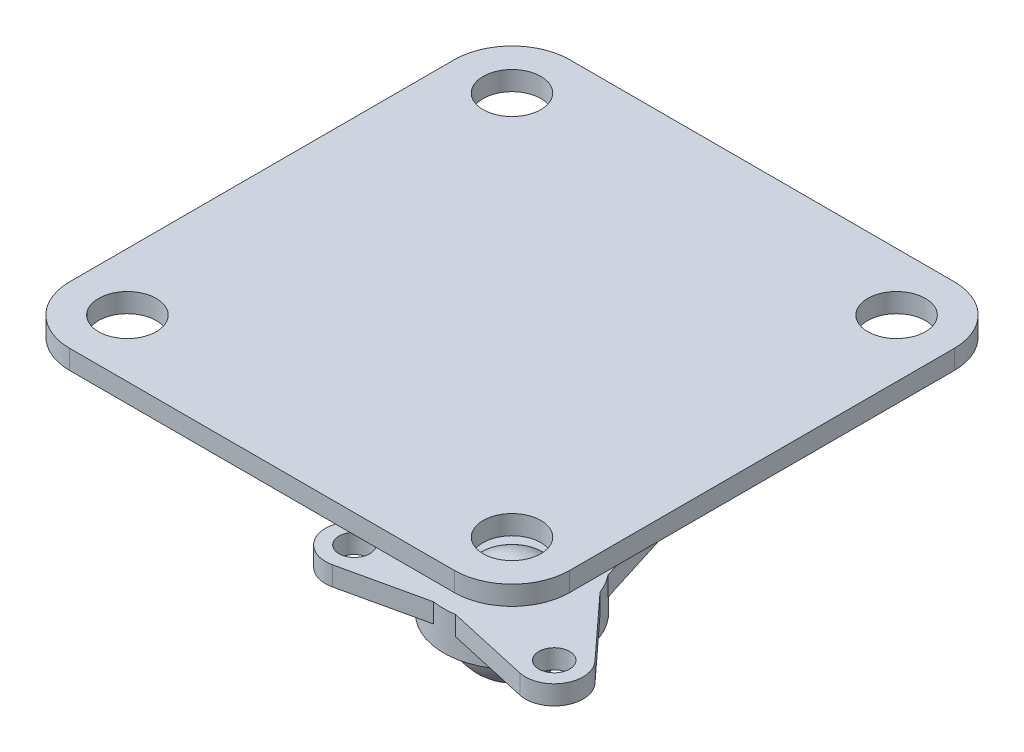
ISO-10303-21;
HEADER;
FILE_DESCRIPTION(('STEP AP214'),'2;1');
FILE_NAME('part.step','',(''),(''),'','','');
FILE_SCHEMA(('AUTOMOTIVE_DESIGN { 1 0 10303 214 1 1 1 1 }'));
ENDSEC;
DATA;
#1=APPLICATION_CONTEXT('core data for automotive mechanical design processes');
#2=APPLICATION_PROTOCOL_DEFINITION('international standard','automotive_design',2000,#1);
#3=PRODUCT_CONTEXT('',#1,'mechanical');
#4=PRODUCT('Part','Part','',(#3));
#5=PRODUCT_RELATED_PRODUCT_CATEGORY('part','',(#4));
#6=PRODUCT_DEFINITION_FORMATION('','',#4);
#7=PRODUCT_DEFINITION_CONTEXT('part definition',#1,'design');
#8=PRODUCT_DEFINITION('design','',#6,#7);
#9=PRODUCT_DEFINITION_SHAPE('','',#8);
#10=(LENGTH_UNIT() NAMED_UNIT(*) SI_UNIT(.MILLI.,.METRE.));
#11=(NAMED_UNIT(*) PLANE_ANGLE_UNIT() SI_UNIT($,.RADIAN.));
#12=(NAMED_UNIT(*) SI_UNIT($,.STERADIAN.) SOLID_ANGLE_UNIT());
#13=UNCERTAINTY_MEASURE_WITH_UNIT(LENGTH_MEASURE(1.E-05),#10,'distance_accuracy_value','');
#14=(GEOMETRIC_REPRESENTATION_CONTEXT(3) GLOBAL_UNCERTAINTY_ASSIGNED_CONTEXT((#13)) GLOBAL_UNIT_ASSIGNED_CONTEXT((#10,
#11,#12)) REPRESENTATION_CONTEXT('',''));
#15=CARTESIAN_POINT('',(0.,0.,0.));
#16=DIRECTION('',(0.,0.,1.));
#17=DIRECTION('',(1.,0.,0.));
#18=AXIS2_PLACEMENT_3D('',#15,#16,#17);
#19=CARTESIAN_POINT('',(0.,-13.45,0.));
#20=DIRECTION('',(0.,-1.,0.));
#21=DIRECTION('',(1.,0.,0.));
#22=AXIS2_PLACEMENT_3D('',#19,#20,#21);
#23=SPHERICAL_SURFACE('',#22,2.55);
#24=CARTESIAN_POINT('',(0.,-11.45,0.));
#25=DIRECTION('',(0.,1.,0.));
#26=DIRECTION('',(0.,0.,1.));
#27=AXIS2_PLACEMENT_3D('',#24,#25,#26);
#28=CIRCLE('',#27,1.58192920195564);
#29=CARTESIAN_POINT('',(0.,-11.45,1.58192920195564));
#30=VERTEX_POINT('',#29);
#31=EDGE_CURVE('E12',#30,#30,#28,.F.);
#32=ORIENTED_EDGE('',*,*,#31,.F.);
#33=EDGE_LOOP('',(#32));
#34=FACE_BOUND('',#33,.T.);
#35=ADVANCED_FACE('F44',(#34),#23,.T.);
#36=CARTESIAN_POINT('',(3.55,-11.45,0.));
#37=DIRECTION('',(0.,1.,0.));
#38=DIRECTION('',(0.,0.,1.));
#39=AXIS2_PLACEMENT_3D('',#36,#37,#38);
#40=PLANE('',#39);
#41=ORIENTED_EDGE('',*,*,#31,.T.);
#42=EDGE_LOOP('',(#41));
#43=FACE_BOUND('',#42,.T.);
#44=CARTESIAN_POINT('',(0.,-11.45,0.));
#45=DIRECTION('',(0.,-1.,0.));
#46=DIRECTION('',(0.,0.,-1.));
#47=AXIS2_PLACEMENT_3D('',#44,#45,#46);
#48=CIRCLE('',#47,3.55);
#49=CARTESIAN_POINT('',(2.75,-11.45,-2.24499443206437));
#50=VERTEX_POINT('',#49);
#51=CARTESIAN_POINT('',(3.31922220952235,-11.45,-1.25907264437505));
#52=VERTEX_POINT('',#51);
#53=EDGE_CURVE('E245',#50,#52,#48,.T.);
#54=ORIENTED_EDGE('',*,*,#53,.F.);
#55=DIRECTION('',(-0.299313913139755,0.,-0.954154694691048));
#56=VECTOR('',#55,1.);
#57=CARTESIAN_POINT('',(1.43123204203657,-11.45,-6.44897086970963));
#58=LINE('',#57,#56);
#59=CARTESIAN_POINT('',(1.43123204203657,-11.45,-6.44897086970963));
#60=VERTEX_POINT('',#59);
#61=EDGE_CURVE('E209',#50,#60,#58,.T.);
#62=ORIENTED_EDGE('',*,*,#61,.T.);
#63=CARTESIAN_POINT('',(0.,-11.45,-6.));
#64=DIRECTION('',(0.,1.,0.));
#65=DIRECTION('',(0.,0.,1.));
#66=AXIS2_PLACEMENT_3D('',#63,#64,#65);
#67=CIRCLE('',#66,1.5);
#68=CARTESIAN_POINT('',(-1.43123204203657,-11.45,-6.44897086970963));
#69=VERTEX_POINT('',#68);
#70=EDGE_CURVE('E227',#60,#69,#67,.T.);
#71=ORIENTED_EDGE('',*,*,#70,.T.);
#72=DIRECTION('',(-0.299313913139755,0.,0.954154694691048));
#73=VECTOR('',#72,1.);
#74=CARTESIAN_POINT('',(-2.75,-11.45,-2.24499443206437));
#75=LINE('',#74,#73);
#76=CARTESIAN_POINT('',(-2.75,-11.45,-2.24499443206437));
#77=VERTEX_POINT('',#76);
#78=EDGE_CURVE('E215',#69,#77,#75,.T.);
#79=ORIENTED_EDGE('',*,*,#78,.T.);
#80=CARTESIAN_POINT('',(-3.31922220952236,-11.45,-1.25907264437501));
#81=VERTEX_POINT('',#80);
#82=EDGE_CURVE('E244',#81,#77,#48,.T.);
#83=ORIENTED_EDGE('',*,*,#82,.F.);
#84=DIRECTION('',(-0.676665248172752,0.,0.736290799830684));
#85=VECTOR('',#84,1.);
#86=CARTESIAN_POINT('',(-6.30058862245265,-11.45,1.9850021277409));
#87=LINE('',#86,#85);
#88=CARTESIAN_POINT('',(-6.30058862245265,-11.45,1.9850021277409));
#89=VERTEX_POINT('',#88);
#90=EDGE_CURVE('E173',#81,#89,#87,.T.);
#91=ORIENTED_EDGE('',*,*,#90,.T.);
#92=CARTESIAN_POINT('',(-5.19615242270662,-11.45,3.00000000000002));
#93=DIRECTION('',(0.,1.,0.));
#94=DIRECTION('',(0.866025403784436,0.,-0.500000000000004));
#95=AXIS2_PLACEMENT_3D('',#92,#93,#94);
#96=CIRCLE('',#95,1.5);
#97=CARTESIAN_POINT('',(-4.86935658041606,-11.45,4.46396874196879));
#98=VERTEX_POINT('',#97);
#99=EDGE_CURVE('E191',#89,#98,#96,.T.);
#100=ORIENTED_EDGE('',*,*,#99,.T.);
#101=DIRECTION('',(0.97597916131251,0.,-0.217863894860372));
#102=VECTOR('',#101,1.);
#103=CARTESIAN_POINT('',(-0.569222209522342,-11.45,3.50406707643939));
#104=LINE('',#103,#102);
#105=CARTESIAN_POINT('',(-0.569222209522342,-11.45,3.50406707643939));
#106=VERTEX_POINT('',#105);
#107=EDGE_CURVE('E179',#98,#106,#104,.T.);
#108=ORIENTED_EDGE('',*,*,#107,.T.);
#109=CARTESIAN_POINT('',(0.569222209522391,-11.45,3.50406707643938));
#110=VERTEX_POINT('',#109);
#111=EDGE_CURVE('E246',#110,#106,#48,.T.);
#112=ORIENTED_EDGE('',*,*,#111,.F.);
#113=DIRECTION('',(0.975979161312512,0.,0.217863894860358));
#114=VECTOR('',#113,1.);
#115=CARTESIAN_POINT('',(4.86935658041612,-11.45,4.46396874196872));
#116=LINE('',#115,#114);
#117=CARTESIAN_POINT('',(4.86935658041612,-11.45,4.46396874196872));
#118=VERTEX_POINT('',#117);
#119=EDGE_CURVE('E160',#110,#118,#116,.T.);
#120=ORIENTED_EDGE('',*,*,#119,.T.);
#121=CARTESIAN_POINT('',(5.19615242270666,-11.45,2.99999999999995));
#122=DIRECTION('',(0.,1.,0.));
#123=DIRECTION('',(-0.866025403784443,0.,-0.499999999999992));
#124=AXIS2_PLACEMENT_3D('',#121,#122,#123);
#125=CIRCLE('',#124,1.5);
#126=CARTESIAN_POINT('',(6.30058862245267,-11.45,1.98500212774081));
#127=VERTEX_POINT('',#126);
#128=EDGE_CURVE('E138',#118,#127,#125,.T.);
#129=ORIENTED_EDGE('',*,*,#128,.T.);
#130=DIRECTION('',(-0.676665248172762,0.,-0.736290799830675));
#131=VECTOR('',#130,1.);
#132=CARTESIAN_POINT('',(3.31922220952235,-11.45,-1.25907264437505));
#133=LINE('',#132,#131);
#134=EDGE_CURVE('E155',#127,#52,#133,.T.);
#135=ORIENTED_EDGE('',*,*,#134,.T.);
#136=EDGE_LOOP('',(#54,#62,#71,#79,#83,#91,#100,#108,#112,#120,#129,#135));
#137=FACE_BOUND('',#136,.T.);
#138=CARTESIAN_POINT('',(0.,-11.45,-6.));
#139=DIRECTION('',(0.,1.,0.));
#140=DIRECTION('',(0.,0.,1.));
#141=AXIS2_PLACEMENT_3D('',#138,#139,#140);
#142=CIRCLE('',#141,0.8);
#143=CARTESIAN_POINT('',(0.,-11.45,-5.2));
#144=VERTEX_POINT('',#143);
#145=EDGE_CURVE('E199',#144,#144,#142,.T.);
#146=ORIENTED_EDGE('',*,*,#145,.F.);
#147=EDGE_LOOP('',(#146));
#148=FACE_BOUND('',#147,.T.);
#149=CARTESIAN_POINT('',(-5.19615242270662,-11.45,3.00000000000002));
#150=DIRECTION('',(0.,1.,0.));
#151=DIRECTION('',(0.866025403784436,0.,-0.500000000000004));
#152=AXIS2_PLACEMENT_3D('',#149,#150,#151);
#153=CIRCLE('',#152,0.8);
#154=CARTESIAN_POINT('',(-4.50333209967907,-11.45,2.60000000000002));
#155=VERTEX_POINT('',#154);
#156=EDGE_CURVE('E167',#155,#155,#153,.T.);
#157=ORIENTED_EDGE('',*,*,#156,.F.);
#158=EDGE_LOOP('',(#157));
#159=FACE_BOUND('',#158,.T.);
#160=CARTESIAN_POINT('',(5.19615242270666,-11.45,2.99999999999995));
#161=DIRECTION('',(0.,1.,0.));
#162=DIRECTION('',(-0.866025403784443,0.,-0.499999999999992));
#163=AXIS2_PLACEMENT_3D('',#160,#161,#162);
#164=CIRCLE('',#163,0.8);
#165=CARTESIAN_POINT('',(4.50333209967911,-11.45,2.59999999999996));
#166=VERTEX_POINT('',#165);
#167=EDGE_CURVE('E280',#166,#166,#164,.T.);
#168=ORIENTED_EDGE('',*,*,#167,.F.);
#169=EDGE_LOOP('',(#168));
#170=FACE_BOUND('',#169,.T.);
#171=ADVANCED_FACE('F265',(#43,#137,#148,#159,#170),#40,.T.);
#172=CARTESIAN_POINT('',(0.,-13.45,0.));
#173=DIRECTION('',(0.,-1.,0.));
#174=DIRECTION('',(0.,0.,-1.));
#175=AXIS2_PLACEMENT_3D('',#172,#173,#174);
#176=CYLINDRICAL_SURFACE('',#175,3.55);
#177=DIRECTION('',(0.,1.,0.));
#178=VECTOR('',#177,1.);
#179=CARTESIAN_POINT('',(3.31922220952235,-12.45,-1.25907264437505));
#180=LINE('',#179,#178);
#181=CARTESIAN_POINT('',(3.31922220952235,-12.45,-1.25907264437505));
#182=VERTEX_POINT('',#181);
#183=EDGE_CURVE('E59',#182,#52,#180,.T.);
#184=ORIENTED_EDGE('',*,*,#183,.F.);
#185=CARTESIAN_POINT('',(0.,-12.45,0.));
#186=DIRECTION('',(0.,-1.,0.));
#187=DIRECTION('',(0.866025403784443,0.,0.499999999999992));
#188=AXIS2_PLACEMENT_3D('',#185,#186,#187);
#189=CIRCLE('',#188,3.55);
#190=CARTESIAN_POINT('',(0.569222209522391,-12.45,3.50406707643938));
#191=VERTEX_POINT('',#190);
#192=EDGE_CURVE('E63',#182,#191,#189,.T.);
#193=ORIENTED_EDGE('',*,*,#192,.T.);
#194=DIRECTION('',(0.,1.,0.));
#195=VECTOR('',#194,1.);
#196=CARTESIAN_POINT('',(0.569222209522391,-12.45,3.50406707643938));
#197=LINE('',#196,#195);
#198=EDGE_CURVE('E144',#191,#110,#197,.T.);
#199=ORIENTED_EDGE('',*,*,#198,.T.);
#200=ORIENTED_EDGE('',*,*,#111,.T.);
#201=DIRECTION('',(0.,1.,0.));
#202=VECTOR('',#201,1.);
#203=CARTESIAN_POINT('',(-0.569222209522342,-12.45,3.50406707643939));
#204=LINE('',#203,#202);
#205=CARTESIAN_POINT('',(-0.569222209522342,-12.45,3.50406707643939));
#206=VERTEX_POINT('',#205);
#207=EDGE_CURVE('E196',#206,#106,#204,.T.);
#208=ORIENTED_EDGE('',*,*,#207,.F.);
#209=CARTESIAN_POINT('',(0.,-12.45,0.));
#210=DIRECTION('',(0.,-1.,0.));
#211=DIRECTION('',(-0.866025403784436,0.,0.500000000000004));
#212=AXIS2_PLACEMENT_3D('',#209,#210,#211);
#213=CIRCLE('',#212,3.55);
#214=CARTESIAN_POINT('',(-3.31922220952236,-12.45,-1.25907264437501));
#215=VERTEX_POINT('',#214);
#216=EDGE_CURVE('E176',#206,#215,#213,.T.);
#217=ORIENTED_EDGE('',*,*,#216,.T.);
#218=DIRECTION('',(0.,1.,0.));
#219=VECTOR('',#218,1.);
#220=CARTESIAN_POINT('',(-3.31922220952236,-12.45,-1.25907264437501));
#221=LINE('',#220,#219);
#222=EDGE_CURVE('E188',#215,#81,#221,.T.);
#223=ORIENTED_EDGE('',*,*,#222,.T.);
#224=ORIENTED_EDGE('',*,*,#82,.T.);
#225=DIRECTION('',(0.,1.,0.));
#226=VECTOR('',#225,1.);
#227=CARTESIAN_POINT('',(-2.75,-12.45,-2.24499443206437));
#228=LINE('',#227,#226);
#229=CARTESIAN_POINT('',(-2.75,-12.45,-2.24499443206437));
#230=VERTEX_POINT('',#229);
#231=EDGE_CURVE('E232',#230,#77,#228,.T.);
#232=ORIENTED_EDGE('',*,*,#231,.F.);
#233=CARTESIAN_POINT('',(0.,-12.45,0.));
#234=DIRECTION('',(0.,-1.,0.));
#235=DIRECTION('',(0.,0.,-1.));
#236=AXIS2_PLACEMENT_3D('',#233,#234,#235);
#237=CIRCLE('',#236,3.55);
#238=CARTESIAN_POINT('',(2.75,-12.45,-2.24499443206437));
#239=VERTEX_POINT('',#238);
#240=EDGE_CURVE('E212',#230,#239,#237,.T.);
#241=ORIENTED_EDGE('',*,*,#240,.T.);
#242=DIRECTION('',(0.,1.,0.));
#243=VECTOR('',#242,1.);
#244=CARTESIAN_POINT('',(2.75,-12.45,-2.24499443206437));
#245=LINE('',#244,#243);
#246=EDGE_CURVE('E224',#239,#50,#245,.T.);
#247=ORIENTED_EDGE('',*,*,#246,.T.);
#248=ORIENTED_EDGE('',*,*,#53,.T.);
#249=EDGE_LOOP('',(#184,#193,#199,#200,#208,#217,#223,#224,#232,#241,#247,#248));
#250=FACE_BOUND('',#249,.T.);
#251=CARTESIAN_POINT('',(0.,-13.45,0.));
#252=DIRECTION('',(0.,-1.,0.));
#253=DIRECTION('',(0.,0.,-1.));
#254=AXIS2_PLACEMENT_3D('',#251,#252,#253);
#255=CIRCLE('',#254,3.55);
#256=CARTESIAN_POINT('',(0.,-13.45,-3.55));
#257=VERTEX_POINT('',#256);
#258=EDGE_CURVE('E235',#257,#257,#255,.T.);
#259=ORIENTED_EDGE('',*,*,#258,.F.);
#260=EDGE_LOOP('',(#259));
#261=FACE_BOUND('',#260,.T.);
#262=ADVANCED_FACE('F261',(#250,#261),#176,.T.);
#263=CARTESIAN_POINT('',(2.55,-13.45,0.));
#264=DIRECTION('',(0.,-1.,0.));
#265=DIRECTION('',(0.,0.,-1.));
#266=AXIS2_PLACEMENT_3D('',#263,#264,#265);
#267=PLANE('',#266);
#268=ORIENTED_EDGE('',*,*,#258,.T.);
#269=EDGE_LOOP('',(#268));
#270=FACE_BOUND('',#269,.T.);
#271=CARTESIAN_POINT('',(0.,-13.45,0.));
#272=DIRECTION('',(0.,-1.,0.));
#273=DIRECTION('',(0.,0.,-1.));
#274=AXIS2_PLACEMENT_3D('',#271,#272,#273);
#275=CIRCLE('',#274,2.55);
#276=CARTESIAN_POINT('',(0.,-13.45,-2.55));
#277=VERTEX_POINT('',#276);
#278=EDGE_CURVE('E52',#277,#277,#275,.F.);
#279=ORIENTED_EDGE('',*,*,#278,.T.);
#280=EDGE_LOOP('',(#279));
#281=FACE_BOUND('',#280,.T.);
#282=ADVANCED_FACE('F250',(#270,#281),#267,.T.);
#283=ORIENTED_EDGE('',*,*,#278,.F.);
#284=EDGE_LOOP('',(#283));
#285=FACE_BOUND('',#284,.T.);
#286=ADVANCED_FACE('F46',(#285),#23,.T.);
#287=CARTESIAN_POINT('',(-2.75,-12.45,-2.24499443206437));
#288=DIRECTION('',(-0.954154694691048,0.,-0.299313913139755));
#289=DIRECTION('',(-0.299313913139755,0.,0.954154694691048));
#290=AXIS2_PLACEMENT_3D('',#287,#288,#289);
#291=PLANE('',#290);
#292=ORIENTED_EDGE('',*,*,#78,.F.);
#293=DIRECTION('',(0.,1.,0.));
#294=VECTOR('',#293,1.);
#295=CARTESIAN_POINT('',(-1.43123204203657,-12.45,-6.44897086970963));
#296=LINE('',#295,#294);
#297=CARTESIAN_POINT('',(-1.43123204203657,-12.45,-6.44897086970963));
#298=VERTEX_POINT('',#297);
#299=EDGE_CURVE('E236',#298,#69,#296,.T.);
#300=ORIENTED_EDGE('',*,*,#299,.F.);
#301=DIRECTION('',(-0.299313913139755,0.,0.954154694691048));
#302=VECTOR('',#301,1.);
#303=CARTESIAN_POINT('',(-2.75,-12.45,-2.24499443206437));
#304=LINE('',#303,#302);
#305=EDGE_CURVE('E221',#298,#230,#304,.T.);
#306=ORIENTED_EDGE('',*,*,#305,.T.);
#307=ORIENTED_EDGE('',*,*,#231,.T.);
#308=EDGE_LOOP('',(#292,#300,#306,#307));
#309=FACE_BOUND('',#308,.T.);
#310=ADVANCED_FACE('F253',(#309),#291,.T.);
#311=CARTESIAN_POINT('',(0.,-12.45,-6.));
#312=DIRECTION('',(0.,1.,0.));
#313=DIRECTION('',(0.,0.,1.));
#314=AXIS2_PLACEMENT_3D('',#311,#312,#313);
#315=CYLINDRICAL_SURFACE('',#314,1.5);
#316=ORIENTED_EDGE('',*,*,#70,.F.);
#317=DIRECTION('',(0.,1.,0.));
#318=VECTOR('',#317,1.);
#319=CARTESIAN_POINT('',(1.43123204203657,-12.45,-6.44897086970963));
#320=LINE('',#319,#318);
#321=CARTESIAN_POINT('',(1.43123204203657,-12.45,-6.44897086970963));
#322=VERTEX_POINT('',#321);
#323=EDGE_CURVE('E238',#322,#60,#320,.T.);
#324=ORIENTED_EDGE('',*,*,#323,.F.);
#325=CARTESIAN_POINT('',(0.,-12.45,-6.));
#326=DIRECTION('',(0.,1.,0.));
#327=DIRECTION('',(0.,0.,1.));
#328=AXIS2_PLACEMENT_3D('',#325,#326,#327);
#329=CIRCLE('',#328,1.5);
#330=EDGE_CURVE('E218',#322,#298,#329,.T.);
#331=ORIENTED_EDGE('',*,*,#330,.T.);
#332=ORIENTED_EDGE('',*,*,#299,.T.);
#333=EDGE_LOOP('',(#316,#324,#331,#332));
#334=FACE_BOUND('',#333,.T.);
#335=ADVANCED_FACE('F258',(#334),#315,.T.);
#336=CARTESIAN_POINT('',(1.43123204203657,-12.45,-6.44897086970963));
#337=DIRECTION('',(0.954154694691048,0.,-0.299313913139755));
#338=DIRECTION('',(-0.299313913139755,0.,-0.954154694691048));
#339=AXIS2_PLACEMENT_3D('',#336,#337,#338);
#340=PLANE('',#339);
#341=ORIENTED_EDGE('',*,*,#61,.F.);
#342=ORIENTED_EDGE('',*,*,#246,.F.);
#343=DIRECTION('',(-0.299313913139755,0.,-0.954154694691048));
#344=VECTOR('',#343,1.);
#345=CARTESIAN_POINT('',(1.43123204203657,-12.45,-6.44897086970963));
#346=LINE('',#345,#344);
#347=EDGE_CURVE('E214',#239,#322,#346,.T.);
#348=ORIENTED_EDGE('',*,*,#347,.T.);
#349=ORIENTED_EDGE('',*,*,#323,.T.);
#350=EDGE_LOOP('',(#341,#342,#348,#349));
#351=FACE_BOUND('',#350,.T.);
#352=ADVANCED_FACE('F329',(#351),#340,.T.);
#353=CARTESIAN_POINT('',(0.,-12.45,0.));
#354=DIRECTION('',(0.,-1.,0.));
#355=DIRECTION('',(0.,0.,-1.));
#356=AXIS2_PLACEMENT_3D('',#353,#354,#355);
#357=PLANE('',#356);
#358=CARTESIAN_POINT('',(0.,-12.45,-6.));
#359=DIRECTION('',(0.,1.,0.));
#360=DIRECTION('',(0.,0.,1.));
#361=AXIS2_PLACEMENT_3D('',#358,#359,#360);
#362=CIRCLE('',#361,0.8);
#363=CARTESIAN_POINT('',(0.,-12.45,-5.2));
#364=VERTEX_POINT('',#363);
#365=EDGE_CURVE('E206',#364,#364,#362,.T.);
#366=ORIENTED_EDGE('',*,*,#365,.T.);
#367=EDGE_LOOP('',(#366));
#368=FACE_BOUND('',#367,.T.);
#369=ORIENTED_EDGE('',*,*,#240,.F.);
#370=ORIENTED_EDGE('',*,*,#305,.F.);
#371=ORIENTED_EDGE('',*,*,#330,.F.);
#372=ORIENTED_EDGE('',*,*,#347,.F.);
#373=EDGE_LOOP('',(#369,#370,#371,#372));
#374=FACE_BOUND('',#373,.T.);
#375=ADVANCED_FACE('F326',(#368,#374),#357,.T.);
#376=CARTESIAN_POINT('',(0.,-12.45,-6.));
#377=DIRECTION('',(0.,1.,0.));
#378=DIRECTION('',(0.,0.,1.));
#379=AXIS2_PLACEMENT_3D('',#376,#377,#378);
#380=CYLINDRICAL_SURFACE('',#379,0.8);
#381=ORIENTED_EDGE('',*,*,#365,.F.);
#382=EDGE_LOOP('',(#381));
#383=FACE_BOUND('',#382,.T.);
#384=ORIENTED_EDGE('',*,*,#145,.T.);
#385=EDGE_LOOP('',(#384));
#386=FACE_BOUND('',#385,.T.);
#387=ADVANCED_FACE('F316',(#383,#386),#380,.F.);
#388=CARTESIAN_POINT('',(-0.569222209522342,-12.45,3.50406707643939));
#389=DIRECTION('',(0.217863894860372,0.,0.975979161312509));
#390=DIRECTION('',(0.975979161312509,0.,-0.217863894860372));
#391=AXIS2_PLACEMENT_3D('',#388,#389,#390);
#392=PLANE('',#391);
#393=ORIENTED_EDGE('',*,*,#107,.F.);
#394=DIRECTION('',(0.,1.,0.));
#395=VECTOR('',#394,1.);
#396=CARTESIAN_POINT('',(-4.86935658041606,-12.45,4.46396874196879));
#397=LINE('',#396,#395);
#398=CARTESIAN_POINT('',(-4.86935658041606,-12.45,4.46396874196879));
#399=VERTEX_POINT('',#398);
#400=EDGE_CURVE('E200',#399,#98,#397,.T.);
#401=ORIENTED_EDGE('',*,*,#400,.F.);
#402=DIRECTION('',(0.97597916131251,0.,-0.217863894860372));
#403=VECTOR('',#402,1.);
#404=CARTESIAN_POINT('',(-0.569222209522342,-12.45,3.50406707643939));
#405=LINE('',#404,#403);
#406=EDGE_CURVE('E185',#399,#206,#405,.T.);
#407=ORIENTED_EDGE('',*,*,#406,.T.);
#408=ORIENTED_EDGE('',*,*,#207,.T.);
#409=EDGE_LOOP('',(#393,#401,#407,#408));
#410=FACE_BOUND('',#409,.T.);
#411=ADVANCED_FACE('F312',(#410),#392,.T.);
#412=CARTESIAN_POINT('',(-5.19615242270662,-12.45,3.00000000000002));
#413=DIRECTION('',(0.,1.,0.));
#414=DIRECTION('',(0.,0.,1.));
#415=AXIS2_PLACEMENT_3D('',#412,#413,#414);
#416=CYLINDRICAL_SURFACE('',#415,1.5);
#417=ORIENTED_EDGE('',*,*,#99,.F.);
#418=DIRECTION('',(0.,1.,0.));
#419=VECTOR('',#418,1.);
#420=CARTESIAN_POINT('',(-6.30058862245265,-12.45,1.9850021277409));
#421=LINE('',#420,#419);
#422=CARTESIAN_POINT('',(-6.30058862245265,-12.45,1.9850021277409));
#423=VERTEX_POINT('',#422);
#424=EDGE_CURVE('E202',#423,#89,#421,.T.);
#425=ORIENTED_EDGE('',*,*,#424,.F.);
#426=CARTESIAN_POINT('',(-5.19615242270662,-12.45,3.00000000000002));
#427=DIRECTION('',(0.,1.,0.));
#428=DIRECTION('',(0.866025403784436,0.,-0.500000000000004));
#429=AXIS2_PLACEMENT_3D('',#426,#427,#428);
#430=CIRCLE('',#429,1.5);
#431=EDGE_CURVE('E182',#423,#399,#430,.T.);
#432=ORIENTED_EDGE('',*,*,#431,.T.);
#433=ORIENTED_EDGE('',*,*,#400,.T.);
#434=EDGE_LOOP('',(#417,#425,#432,#433));
#435=FACE_BOUND('',#434,.T.);
#436=ADVANCED_FACE('F315',(#435),#416,.T.);
#437=CARTESIAN_POINT('',(-6.30058862245265,-12.45,1.9850021277409));
#438=DIRECTION('',(-0.736290799830684,0.,-0.676665248172752));
#439=DIRECTION('',(-0.676665248172752,0.,0.736290799830684));
#440=AXIS2_PLACEMENT_3D('',#437,#438,#439);
#441=PLANE('',#440);
#442=ORIENTED_EDGE('',*,*,#90,.F.);
#443=ORIENTED_EDGE('',*,*,#222,.F.);
#444=DIRECTION('',(-0.676665248172752,0.,0.736290799830684));
#445=VECTOR('',#444,1.);
#446=CARTESIAN_POINT('',(-6.30058862245265,-12.45,1.9850021277409));
#447=LINE('',#446,#445);
#448=EDGE_CURVE('E178',#215,#423,#447,.T.);
#449=ORIENTED_EDGE('',*,*,#448,.T.);
#450=ORIENTED_EDGE('',*,*,#424,.T.);
#451=EDGE_LOOP('',(#442,#443,#449,#450));
#452=FACE_BOUND('',#451,.T.);
#453=ADVANCED_FACE('F310',(#452),#441,.T.);
#454=CARTESIAN_POINT('',(0.,-12.45,0.));
#455=DIRECTION('',(0.,-1.,0.));
#456=DIRECTION('',(-0.866025403784436,0.,0.500000000000004));
#457=AXIS2_PLACEMENT_3D('',#454,#455,#456);
#458=PLANE('',#457);
#459=CARTESIAN_POINT('',(-5.19615242270662,-12.45,3.00000000000002));
#460=DIRECTION('',(0.,1.,0.));
#461=DIRECTION('',(0.866025403784436,0.,-0.500000000000004));
#462=AXIS2_PLACEMENT_3D('',#459,#460,#461);
#463=CIRCLE('',#462,0.8);
#464=CARTESIAN_POINT('',(-4.50333209967907,-12.45,2.60000000000002));
#465=VERTEX_POINT('',#464);
#466=EDGE_CURVE('E170',#465,#465,#463,.T.);
#467=ORIENTED_EDGE('',*,*,#466,.T.);
#468=EDGE_LOOP('',(#467));
#469=FACE_BOUND('',#468,.T.);
#470=ORIENTED_EDGE('',*,*,#216,.F.);
#471=ORIENTED_EDGE('',*,*,#406,.F.);
#472=ORIENTED_EDGE('',*,*,#431,.F.);
#473=ORIENTED_EDGE('',*,*,#448,.F.);
#474=EDGE_LOOP('',(#470,#471,#472,#473));
#475=FACE_BOUND('',#474,.T.);
#476=ADVANCED_FACE('F306',(#469,#475),#458,.T.);
#477=CARTESIAN_POINT('',(-5.19615242270662,-12.45,3.00000000000002));
#478=DIRECTION('',(0.,1.,0.));
#479=DIRECTION('',(0.,0.,1.));
#480=AXIS2_PLACEMENT_3D('',#477,#478,#479);
#481=CYLINDRICAL_SURFACE('',#480,0.8);
#482=ORIENTED_EDGE('',*,*,#466,.F.);
#483=EDGE_LOOP('',(#482));
#484=FACE_BOUND('',#483,.T.);
#485=ORIENTED_EDGE('',*,*,#156,.T.);
#486=EDGE_LOOP('',(#485));
#487=FACE_BOUND('',#486,.T.);
#488=ADVANCED_FACE('F298',(#484,#487),#481,.F.);
#489=CARTESIAN_POINT('',(3.31922220952235,-12.45,-1.25907264437505));
#490=DIRECTION('',(0.736290799830675,0.,-0.676665248172762));
#491=DIRECTION('',(-0.676665248172762,0.,-0.736290799830675));
#492=AXIS2_PLACEMENT_3D('',#489,#490,#491);
#493=PLANE('',#492);
#494=ORIENTED_EDGE('',*,*,#134,.F.);
#495=DIRECTION('',(0.,1.,0.));
#496=VECTOR('',#495,1.);
#497=CARTESIAN_POINT('',(6.30058862245267,-12.45,1.98500212774081));
#498=LINE('',#497,#496);
#499=CARTESIAN_POINT('',(6.30058862245267,-12.45,1.98500212774081));
#500=VERTEX_POINT('',#499);
#501=EDGE_CURVE('E143',#500,#127,#498,.T.);
#502=ORIENTED_EDGE('',*,*,#501,.F.);
#503=DIRECTION('',(-0.676665248172762,0.,-0.736290799830675));
#504=VECTOR('',#503,1.);
#505=CARTESIAN_POINT('',(3.31922220952235,-12.45,-1.25907264437505));
#506=LINE('',#505,#504);
#507=EDGE_CURVE('E151',#500,#182,#506,.T.);
#508=ORIENTED_EDGE('',*,*,#507,.T.);
#509=ORIENTED_EDGE('',*,*,#183,.T.);
#510=EDGE_LOOP('',(#494,#502,#508,#509));
#511=FACE_BOUND('',#510,.T.);
#512=ADVANCED_FACE('F295',(#511),#493,.T.);
#513=CARTESIAN_POINT('',(5.19615242270666,-12.45,2.99999999999995));
#514=DIRECTION('',(0.,1.,0.));
#515=DIRECTION('',(0.,0.,1.));
#516=AXIS2_PLACEMENT_3D('',#513,#514,#515);
#517=CYLINDRICAL_SURFACE('',#516,1.5);
#518=ORIENTED_EDGE('',*,*,#128,.F.);
#519=DIRECTION('',(0.,1.,0.));
#520=VECTOR('',#519,1.);
#521=CARTESIAN_POINT('',(4.86935658041612,-12.45,4.46396874196872));
#522=LINE('',#521,#520);
#523=CARTESIAN_POINT('',(4.86935658041612,-12.45,4.46396874196872));
#524=VERTEX_POINT('',#523);
#525=EDGE_CURVE('E132',#524,#118,#522,.T.);
#526=ORIENTED_EDGE('',*,*,#525,.F.);
#527=CARTESIAN_POINT('',(5.19615242270666,-12.45,2.99999999999995));
#528=DIRECTION('',(0.,1.,0.));
#529=DIRECTION('',(-0.866025403784443,0.,-0.499999999999992));
#530=AXIS2_PLACEMENT_3D('',#527,#528,#529);
#531=CIRCLE('',#530,1.5);
#532=EDGE_CURVE('E135',#524,#500,#531,.T.);
#533=ORIENTED_EDGE('',*,*,#532,.T.);
#534=ORIENTED_EDGE('',*,*,#501,.T.);
#535=EDGE_LOOP('',(#518,#526,#533,#534));
#536=FACE_BOUND('',#535,.T.);
#537=ADVANCED_FACE('F134',(#536),#517,.T.);
#538=CARTESIAN_POINT('',(4.86935658041612,-12.45,4.46396874196872));
#539=DIRECTION('',(-0.217863894860358,0.,0.975979161312512));
#540=DIRECTION('',(0.975979161312512,0.,0.217863894860358));
#541=AXIS2_PLACEMENT_3D('',#538,#539,#540);
#542=PLANE('',#541);
#543=ORIENTED_EDGE('',*,*,#119,.F.);
#544=ORIENTED_EDGE('',*,*,#198,.F.);
#545=DIRECTION('',(0.975979161312512,0.,0.217863894860358));
#546=VECTOR('',#545,1.);
#547=CARTESIAN_POINT('',(4.86935658041612,-12.45,4.46396874196872));
#548=LINE('',#547,#546);
#549=EDGE_CURVE('E149',#191,#524,#548,.T.);
#550=ORIENTED_EDGE('',*,*,#549,.T.);
#551=ORIENTED_EDGE('',*,*,#525,.T.);
#552=EDGE_LOOP('',(#543,#544,#550,#551));
#553=FACE_BOUND('',#552,.T.);
#554=ADVANCED_FACE('F153',(#553),#542,.T.);
#555=CARTESIAN_POINT('',(0.,-12.45,0.));
#556=DIRECTION('',(0.,-1.,0.));
#557=DIRECTION('',(0.866025403784443,0.,0.499999999999992));
#558=AXIS2_PLACEMENT_3D('',#555,#556,#557);
#559=PLANE('',#558);
#560=CARTESIAN_POINT('',(5.19615242270666,-12.45,2.99999999999995));
#561=DIRECTION('',(0.,1.,0.));
#562=DIRECTION('',(-0.866025403784443,0.,-0.499999999999992));
#563=AXIS2_PLACEMENT_3D('',#560,#561,#562);
#564=CIRCLE('',#563,0.8);
#565=CARTESIAN_POINT('',(4.50333209967911,-12.45,2.59999999999996));
#566=VERTEX_POINT('',#565);
#567=EDGE_CURVE('E162',#566,#566,#564,.T.);
#568=ORIENTED_EDGE('',*,*,#567,.T.);
#569=EDGE_LOOP('',(#568));
#570=FACE_BOUND('',#569,.T.);
#571=ORIENTED_EDGE('',*,*,#192,.F.);
#572=ORIENTED_EDGE('',*,*,#507,.F.);
#573=ORIENTED_EDGE('',*,*,#532,.F.);
#574=ORIENTED_EDGE('',*,*,#549,.F.);
#575=EDGE_LOOP('',(#571,#572,#573,#574));
#576=FACE_BOUND('',#575,.T.);
#577=ADVANCED_FACE('F148',(#570,#576),#559,.T.);
#578=CARTESIAN_POINT('',(5.19615242270666,-12.45,2.99999999999995));
#579=DIRECTION('',(0.,1.,0.));
#580=DIRECTION('',(0.,0.,1.));
#581=AXIS2_PLACEMENT_3D('',#578,#579,#580);
#582=CYLINDRICAL_SURFACE('',#581,0.8);
#583=ORIENTED_EDGE('',*,*,#567,.F.);
#584=EDGE_LOOP('',(#583));
#585=FACE_BOUND('',#584,.T.);
#586=ORIENTED_EDGE('',*,*,#167,.T.);
#587=EDGE_LOOP('',(#586));
#588=FACE_BOUND('',#587,.T.);
#589=ADVANCED_FACE('F287',(#585,#588),#582,.F.);
#590=CLOSED_SHELL('',(#35,#171,#262,#282,#286,#310,#335,#352,#375,#387,#411,#436,#453,#476,#488,
#512,#537,#554,#577,#589));
#591=MANIFOLD_SOLID_BREP('B2',#590);
#592=CARTESIAN_POINT('',(-10.,-1.,10.));
#593=DIRECTION('',(0.,1.,0.));
#594=DIRECTION('',(0.,0.,1.));
#595=AXIS2_PLACEMENT_3D('',#592,#593,#594);
#596=CYLINDRICAL_SURFACE('',#595,3.);
#597=CARTESIAN_POINT('',(-10.,0.,10.));
#598=DIRECTION('',(0.,1.,0.));
#599=DIRECTION('',(0.,0.,1.));
#600=AXIS2_PLACEMENT_3D('',#597,#598,#599);
#601=CIRCLE('',#600,3.);
#602=CARTESIAN_POINT('',(-13.,0.,10.));
#603=VERTEX_POINT('',#602);
#604=CARTESIAN_POINT('',(-10.,0.,13.));
#605=VERTEX_POINT('',#604);
#606=EDGE_CURVE('E586',#603,#605,#601,.T.);
#607=ORIENTED_EDGE('',*,*,#606,.F.);
#608=DIRECTION('',(0.,1.,0.));
#609=VECTOR('',#608,1.);
#610=CARTESIAN_POINT('',(-13.,-1.,10.));
#611=LINE('',#610,#609);
#612=CARTESIAN_POINT('',(-13.,-1.,10.));
#613=VERTEX_POINT('',#612);
#614=EDGE_CURVE('E42',#613,#603,#611,.T.);
#615=ORIENTED_EDGE('',*,*,#614,.F.);
#616=CARTESIAN_POINT('',(-10.,-1.,10.));
#617=DIRECTION('',(0.,1.,0.));
#618=DIRECTION('',(0.,0.,1.));
#619=AXIS2_PLACEMENT_3D('',#616,#617,#618);
#620=CIRCLE('',#619,3.);
#621=CARTESIAN_POINT('',(-10.,-1.,13.));
#622=VERTEX_POINT('',#621);
#623=EDGE_CURVE('E607',#613,#622,#620,.T.);
#624=ORIENTED_EDGE('',*,*,#623,.T.);
#625=DIRECTION('',(0.,1.,0.));
#626=VECTOR('',#625,1.);
#627=CARTESIAN_POINT('',(-10.,-1.,13.));
#628=LINE('',#627,#626);
#629=EDGE_CURVE('E492',#622,#605,#628,.T.);
#630=ORIENTED_EDGE('',*,*,#629,.T.);
#631=EDGE_LOOP('',(#607,#615,#624,#630));
#632=FACE_BOUND('',#631,.T.);
#633=ADVANCED_FACE('F489',(#632),#596,.T.);
#634=CARTESIAN_POINT('',(-13.,-1.,10.));
#635=DIRECTION('',(-1.,0.,0.));
#636=DIRECTION('',(0.,0.,1.));
#637=AXIS2_PLACEMENT_3D('',#634,#635,#636);
#638=PLANE('',#637);
#639=DIRECTION('',(0.,0.,1.));
#640=VECTOR('',#639,1.);
#641=CARTESIAN_POINT('',(-13.,0.,10.));
#642=LINE('',#641,#640);
#643=CARTESIAN_POINT('',(-13.,0.,-10.));
#644=VERTEX_POINT('',#643);
#645=EDGE_CURVE('E605',#644,#603,#642,.T.);
#646=ORIENTED_EDGE('',*,*,#645,.F.);
#647=DIRECTION('',(0.,1.,0.));
#648=VECTOR('',#647,1.);
#649=CARTESIAN_POINT('',(-13.,-1.,-10.));
#650=LINE('',#649,#648);
#651=CARTESIAN_POINT('',(-13.,-1.,-10.));
#652=VERTEX_POINT('',#651);
#653=EDGE_CURVE('E498',#652,#644,#650,.T.);
#654=ORIENTED_EDGE('',*,*,#653,.F.);
#655=DIRECTION('',(0.,0.,1.));
#656=VECTOR('',#655,1.);
#657=CARTESIAN_POINT('',(-13.,-1.,10.));
#658=LINE('',#657,#656);
#659=EDGE_CURVE('E576',#652,#613,#658,.T.);
#660=ORIENTED_EDGE('',*,*,#659,.T.);
#661=ORIENTED_EDGE('',*,*,#614,.T.);
#662=EDGE_LOOP('',(#646,#654,#660,#661));
#663=FACE_BOUND('',#662,.T.);
#664=ADVANCED_FACE('F619',(#663),#638,.T.);
#665=CARTESIAN_POINT('',(-10.,-1.,-10.));
#666=DIRECTION('',(0.,1.,0.));
#667=DIRECTION('',(0.,0.,1.));
#668=AXIS2_PLACEMENT_3D('',#665,#666,#667);
#669=CYLINDRICAL_SURFACE('',#668,3.);
#670=CARTESIAN_POINT('',(-10.,0.,-10.));
#671=DIRECTION('',(0.,1.,0.));
#672=DIRECTION('',(0.,0.,-1.));
#673=AXIS2_PLACEMENT_3D('',#670,#671,#672);
#674=CIRCLE('',#673,3.);
#675=CARTESIAN_POINT('',(-10.,0.,-13.));
#676=VERTEX_POINT('',#675);
#677=EDGE_CURVE('E563',#676,#644,#674,.T.);
#678=ORIENTED_EDGE('',*,*,#677,.F.);
#679=DIRECTION('',(0.,1.,0.));
#680=VECTOR('',#679,1.);
#681=CARTESIAN_POINT('',(-10.,-1.,-13.));
#682=LINE('',#681,#680);
#683=CARTESIAN_POINT('',(-10.,-1.,-13.));
#684=VERTEX_POINT('',#683);
#685=EDGE_CURVE('E558',#684,#676,#682,.T.);
#686=ORIENTED_EDGE('',*,*,#685,.F.);
#687=CARTESIAN_POINT('',(-10.,-1.,-10.));
#688=DIRECTION('',(0.,1.,0.));
#689=DIRECTION('',(0.,0.,-1.));
#690=AXIS2_PLACEMENT_3D('',#687,#688,#689);
#691=CIRCLE('',#690,3.);
#692=EDGE_CURVE('E561',#684,#652,#691,.T.);
#693=ORIENTED_EDGE('',*,*,#692,.T.);
#694=ORIENTED_EDGE('',*,*,#653,.T.);
#695=EDGE_LOOP('',(#678,#686,#693,#694));
#696=FACE_BOUND('',#695,.T.);
#697=ADVANCED_FACE('F560',(#696),#669,.T.);
#698=CARTESIAN_POINT('',(-10.,-1.,-13.));
#699=DIRECTION('',(0.,0.,-1.));
#700=DIRECTION('',(-1.,0.,0.));
#701=AXIS2_PLACEMENT_3D('',#698,#699,#700);
#702=PLANE('',#701);
#703=DIRECTION('',(-1.,0.,0.));
#704=VECTOR('',#703,1.);
#705=CARTESIAN_POINT('',(-10.,0.,-13.));
#706=LINE('',#705,#704);
#707=CARTESIAN_POINT('',(9.99999999999999,0.,-13.));
#708=VERTEX_POINT('',#707);
#709=EDGE_CURVE('E602',#708,#676,#706,.T.);
#710=ORIENTED_EDGE('',*,*,#709,.F.);
#711=DIRECTION('',(0.,1.,0.));
#712=VECTOR('',#711,1.);
#713=CARTESIAN_POINT('',(9.99999999999999,-1.,-13.));
#714=LINE('',#713,#712);
#715=CARTESIAN_POINT('',(9.99999999999999,-1.,-13.));
#716=VERTEX_POINT('',#715);
#717=EDGE_CURVE('E568',#716,#708,#714,.T.);
#718=ORIENTED_EDGE('',*,*,#717,.F.);
#719=DIRECTION('',(-1.,0.,0.));
#720=VECTOR('',#719,1.);
#721=CARTESIAN_POINT('',(-10.,-1.,-13.));
#722=LINE('',#721,#720);
#723=EDGE_CURVE('E574',#716,#684,#722,.T.);
#724=ORIENTED_EDGE('',*,*,#723,.T.);
#725=ORIENTED_EDGE('',*,*,#685,.T.);
#726=EDGE_LOOP('',(#710,#718,#724,#725));
#727=FACE_BOUND('',#726,.T.);
#728=ADVANCED_FACE('F578',(#727),#702,.T.);
#729=CARTESIAN_POINT('',(9.99999999999999,-1.,-10.));
#730=DIRECTION('',(0.,1.,0.));
#731=DIRECTION('',(0.,0.,1.));
#732=AXIS2_PLACEMENT_3D('',#729,#730,#731);
#733=CYLINDRICAL_SURFACE('',#732,3.);
#734=CARTESIAN_POINT('',(9.99999999999999,0.,-10.));
#735=DIRECTION('',(0.,1.,0.));
#736=DIRECTION('',(0.,0.,1.));
#737=AXIS2_PLACEMENT_3D('',#734,#735,#736);
#738=CIRCLE('',#737,3.);
#739=CARTESIAN_POINT('',(13.,0.,-10.));
#740=VERTEX_POINT('',#739);
#741=EDGE_CURVE('E599',#740,#708,#738,.T.);
#742=ORIENTED_EDGE('',*,*,#741,.F.);
#743=DIRECTION('',(0.,1.,0.));
#744=VECTOR('',#743,1.);
#745=CARTESIAN_POINT('',(13.,-1.,-10.));
#746=LINE('',#745,#744);
#747=CARTESIAN_POINT('',(13.,-1.,-10.));
#748=VERTEX_POINT('',#747);
#749=EDGE_CURVE('E611',#748,#740,#746,.T.);
#750=ORIENTED_EDGE('',*,*,#749,.F.);
#751=CARTESIAN_POINT('',(9.99999999999999,-1.,-10.));
#752=DIRECTION('',(0.,1.,0.));
#753=DIRECTION('',(0.,0.,1.));
#754=AXIS2_PLACEMENT_3D('',#751,#752,#753);
#755=CIRCLE('',#754,3.);
#756=EDGE_CURVE('E579',#748,#716,#755,.T.);
#757=ORIENTED_EDGE('',*,*,#756,.T.);
#758=ORIENTED_EDGE('',*,*,#717,.T.);
#759=EDGE_LOOP('',(#742,#750,#757,#758));
#760=FACE_BOUND('',#759,.T.);
#761=ADVANCED_FACE('F632',(#760),#733,.T.);
#762=CARTESIAN_POINT('',(13.,-1.,10.));
#763=DIRECTION('',(1.,0.,0.));
#764=DIRECTION('',(0.,0.,-1.));
#765=AXIS2_PLACEMENT_3D('',#762,#763,#764);
#766=PLANE('',#765);
#767=DIRECTION('',(0.,0.,-1.));
#768=VECTOR('',#767,1.);
#769=CARTESIAN_POINT('',(13.,0.,10.));
#770=LINE('',#769,#768);
#771=CARTESIAN_POINT('',(13.,0.,10.));
#772=VERTEX_POINT('',#771);
#773=EDGE_CURVE('E596',#772,#740,#770,.T.);
#774=ORIENTED_EDGE('',*,*,#773,.F.);
#775=DIRECTION('',(0.,1.,0.));
#776=VECTOR('',#775,1.);
#777=CARTESIAN_POINT('',(13.,-1.,10.));
#778=LINE('',#777,#776);
#779=CARTESIAN_POINT('',(13.,-1.,10.));
#780=VERTEX_POINT('',#779);
#781=EDGE_CURVE('E613',#780,#772,#778,.T.);
#782=ORIENTED_EDGE('',*,*,#781,.F.);
#783=DIRECTION('',(0.,0.,-1.));
#784=VECTOR('',#783,1.);
#785=CARTESIAN_POINT('',(13.,-1.,10.));
#786=LINE('',#785,#784);
#787=EDGE_CURVE('E581',#780,#748,#786,.T.);
#788=ORIENTED_EDGE('',*,*,#787,.T.);
#789=ORIENTED_EDGE('',*,*,#749,.T.);
#790=EDGE_LOOP('',(#774,#782,#788,#789));
#791=FACE_BOUND('',#790,.T.);
#792=ADVANCED_FACE('F635',(#791),#766,.T.);
#793=CARTESIAN_POINT('',(9.99999999999999,-1.,10.));
#794=DIRECTION('',(0.,1.,0.));
#795=DIRECTION('',(0.,0.,1.));
#796=AXIS2_PLACEMENT_3D('',#793,#794,#795);
#797=CYLINDRICAL_SURFACE('',#796,3.);
#798=CARTESIAN_POINT('',(9.99999999999999,0.,10.));
#799=DIRECTION('',(0.,1.,0.));
#800=DIRECTION('',(0.,0.,1.));
#801=AXIS2_PLACEMENT_3D('',#798,#799,#800);
#802=CIRCLE('',#801,3.);
#803=CARTESIAN_POINT('',(9.99999999999999,0.,13.));
#804=VERTEX_POINT('',#803);
#805=EDGE_CURVE('E593',#804,#772,#802,.T.);
#806=ORIENTED_EDGE('',*,*,#805,.F.);
#807=DIRECTION('',(0.,1.,0.));
#808=VECTOR('',#807,1.);
#809=CARTESIAN_POINT('',(9.99999999999999,-1.,13.));
#810=LINE('',#809,#808);
#811=CARTESIAN_POINT('',(9.99999999999999,-1.,13.));
#812=VERTEX_POINT('',#811);
#813=EDGE_CURVE('E614',#812,#804,#810,.T.);
#814=ORIENTED_EDGE('',*,*,#813,.F.);
#815=CARTESIAN_POINT('',(9.99999999999999,-1.,10.));
#816=DIRECTION('',(0.,1.,0.));
#817=DIRECTION('',(0.,0.,1.));
#818=AXIS2_PLACEMENT_3D('',#815,#816,#817);
#819=CIRCLE('',#818,3.);
#820=EDGE_CURVE('E701',#812,#780,#819,.T.);
#821=ORIENTED_EDGE('',*,*,#820,.T.);
#822=ORIENTED_EDGE('',*,*,#781,.T.);
#823=EDGE_LOOP('',(#806,#814,#821,#822));
#824=FACE_BOUND('',#823,.T.);
#825=ADVANCED_FACE('F639',(#824),#797,.T.);
#826=CARTESIAN_POINT('',(-10.,-1.,13.));
#827=DIRECTION('',(0.,0.,1.));
#828=DIRECTION('',(1.,0.,0.));
#829=AXIS2_PLACEMENT_3D('',#826,#827,#828);
#830=PLANE('',#829);
#831=DIRECTION('',(1.,0.,0.));
#832=VECTOR('',#831,1.);
#833=CARTESIAN_POINT('',(-10.,0.,13.));
#834=LINE('',#833,#832);
#835=EDGE_CURVE('E589',#605,#804,#834,.T.);
#836=ORIENTED_EDGE('',*,*,#835,.F.);
#837=ORIENTED_EDGE('',*,*,#629,.F.);
#838=DIRECTION('',(1.,0.,0.));
#839=VECTOR('',#838,1.);
#840=CARTESIAN_POINT('',(-10.,-1.,13.));
#841=LINE('',#840,#839);
#842=EDGE_CURVE('E699',#622,#812,#841,.T.);
#843=ORIENTED_EDGE('',*,*,#842,.T.);
#844=ORIENTED_EDGE('',*,*,#813,.T.);
#845=EDGE_LOOP('',(#836,#837,#843,#844));
#846=FACE_BOUND('',#845,.T.);
#847=ADVANCED_FACE('F616',(#846),#830,.T.);
#848=CARTESIAN_POINT('',(-10.,-1.,10.));
#849=DIRECTION('',(0.,1.,0.));
#850=DIRECTION('',(0.,0.,1.));
#851=AXIS2_PLACEMENT_3D('',#848,#849,#850);
#852=PLANE('',#851);
#853=CARTESIAN_POINT('',(9.99999999999999,-1.,9.99999999999999));
#854=DIRECTION('',(0.,1.,0.));
#855=DIRECTION('',(0.,0.,1.));
#856=AXIS2_PLACEMENT_3D('',#853,#854,#855);
#857=CIRCLE('',#856,1.5);
#858=CARTESIAN_POINT('',(9.99999999999999,-1.,11.5));
#859=VERTEX_POINT('',#858);
#860=EDGE_CURVE('E674',#859,#859,#857,.T.);
#861=ORIENTED_EDGE('',*,*,#860,.T.);
#862=EDGE_LOOP('',(#861));
#863=FACE_BOUND('',#862,.T.);
#864=CARTESIAN_POINT('',(-10.,-1.,10.));
#865=DIRECTION('',(0.,1.,0.));
#866=DIRECTION('',(0.,0.,1.));
#867=AXIS2_PLACEMENT_3D('',#864,#865,#866);
#868=CIRCLE('',#867,1.5);
#869=CARTESIAN_POINT('',(-10.,-1.,11.5));
#870=VERTEX_POINT('',#869);
#871=EDGE_CURVE('E682',#870,#870,#868,.T.);
#872=ORIENTED_EDGE('',*,*,#871,.T.);
#873=EDGE_LOOP('',(#872));
#874=FACE_BOUND('',#873,.T.);
#875=CARTESIAN_POINT('',(9.99999999999999,-1.,-10.));
#876=DIRECTION('',(0.,1.,0.));
#877=DIRECTION('',(0.,0.,1.));
#878=AXIS2_PLACEMENT_3D('',#875,#876,#877);
#879=CIRCLE('',#878,1.5);
#880=CARTESIAN_POINT('',(9.99999999999999,-1.,-8.50000000000001));
#881=VERTEX_POINT('',#880);
#882=EDGE_CURVE('E688',#881,#881,#879,.T.);
#883=ORIENTED_EDGE('',*,*,#882,.T.);
#884=EDGE_LOOP('',(#883));
#885=FACE_BOUND('',#884,.T.);
#886=CARTESIAN_POINT('',(-10.,-1.,-10.));
#887=DIRECTION('',(0.,1.,0.));
#888=DIRECTION('',(0.,0.,1.));
#889=AXIS2_PLACEMENT_3D('',#886,#887,#888);
#890=CIRCLE('',#889,1.5);
#891=CARTESIAN_POINT('',(-10.,-1.,-8.50000000000001));
#892=VERTEX_POINT('',#891);
#893=EDGE_CURVE('E590',#892,#892,#890,.T.);
#894=ORIENTED_EDGE('',*,*,#893,.T.);
#895=EDGE_LOOP('',(#894));
#896=FACE_BOUND('',#895,.T.);
#897=ORIENTED_EDGE('',*,*,#623,.F.);
#898=ORIENTED_EDGE('',*,*,#659,.F.);
#899=ORIENTED_EDGE('',*,*,#692,.F.);
#900=ORIENTED_EDGE('',*,*,#723,.F.);
#901=ORIENTED_EDGE('',*,*,#756,.F.);
#902=ORIENTED_EDGE('',*,*,#787,.F.);
#903=ORIENTED_EDGE('',*,*,#820,.F.);
#904=ORIENTED_EDGE('',*,*,#842,.F.);
#905=EDGE_LOOP('',(#897,#898,#899,#900,#901,#902,#903,#904));
#906=FACE_BOUND('',#905,.T.);
#907=ADVANCED_FACE('F572',(#863,#874,#885,#896,#906),#852,.F.);
#908=CARTESIAN_POINT('',(-10.,0.,10.));
#909=DIRECTION('',(0.,1.,0.));
#910=DIRECTION('',(0.,0.,1.));
#911=AXIS2_PLACEMENT_3D('',#908,#909,#910);
#912=PLANE('',#911);
#913=CARTESIAN_POINT('',(9.99999999999999,0.,9.99999999999999));
#914=DIRECTION('',(0.,1.,0.));
#915=DIRECTION('',(0.,0.,1.));
#916=AXIS2_PLACEMENT_3D('',#913,#914,#915);
#917=CIRCLE('',#916,1.5);
#918=CARTESIAN_POINT('',(9.99999999999999,0.,11.5));
#919=VERTEX_POINT('',#918);
#920=EDGE_CURVE('E677',#919,#919,#917,.T.);
#921=ORIENTED_EDGE('',*,*,#920,.F.);
#922=EDGE_LOOP('',(#921));
#923=FACE_BOUND('',#922,.T.);
#924=CARTESIAN_POINT('',(-10.,0.,10.));
#925=DIRECTION('',(0.,1.,0.));
#926=DIRECTION('',(0.,0.,1.));
#927=AXIS2_PLACEMENT_3D('',#924,#925,#926);
#928=CIRCLE('',#927,1.5);
#929=CARTESIAN_POINT('',(-10.,0.,11.5));
#930=VERTEX_POINT('',#929);
#931=EDGE_CURVE('E679',#930,#930,#928,.T.);
#932=ORIENTED_EDGE('',*,*,#931,.F.);
#933=EDGE_LOOP('',(#932));
#934=FACE_BOUND('',#933,.T.);
#935=CARTESIAN_POINT('',(9.99999999999999,0.,-10.));
#936=DIRECTION('',(0.,1.,0.));
#937=DIRECTION('',(0.,0.,1.));
#938=AXIS2_PLACEMENT_3D('',#935,#936,#937);
#939=CIRCLE('',#938,1.5);
#940=CARTESIAN_POINT('',(9.99999999999999,0.,-8.50000000000001));
#941=VERTEX_POINT('',#940);
#942=EDGE_CURVE('E685',#941,#941,#939,.T.);
#943=ORIENTED_EDGE('',*,*,#942,.F.);
#944=EDGE_LOOP('',(#943));
#945=FACE_BOUND('',#944,.T.);
#946=CARTESIAN_POINT('',(-10.,0.,-10.));
#947=DIRECTION('',(0.,1.,0.));
#948=DIRECTION('',(0.,0.,1.));
#949=AXIS2_PLACEMENT_3D('',#946,#947,#948);
#950=CIRCLE('',#949,1.5);
#951=CARTESIAN_POINT('',(-10.,0.,-8.50000000000001));
#952=VERTEX_POINT('',#951);
#953=EDGE_CURVE('E691',#952,#952,#950,.T.);
#954=ORIENTED_EDGE('',*,*,#953,.F.);
#955=EDGE_LOOP('',(#954));
#956=FACE_BOUND('',#955,.T.);
#957=ORIENTED_EDGE('',*,*,#606,.T.);
#958=ORIENTED_EDGE('',*,*,#835,.T.);
#959=ORIENTED_EDGE('',*,*,#805,.T.);
#960=ORIENTED_EDGE('',*,*,#773,.T.);
#961=ORIENTED_EDGE('',*,*,#741,.T.);
#962=ORIENTED_EDGE('',*,*,#709,.T.);
#963=ORIENTED_EDGE('',*,*,#677,.T.);
#964=ORIENTED_EDGE('',*,*,#645,.T.);
#965=EDGE_LOOP('',(#957,#958,#959,#960,#961,#962,#963,#964));
#966=FACE_BOUND('',#965,.T.);
#967=ADVANCED_FACE('F618',(#923,#934,#945,#956,#966),#912,.T.);
#968=CARTESIAN_POINT('',(-10.,-1.,-10.));
#969=DIRECTION('',(0.,1.,0.));
#970=DIRECTION('',(0.,0.,1.));
#971=AXIS2_PLACEMENT_3D('',#968,#969,#970);
#972=CYLINDRICAL_SURFACE('',#971,1.5);
#973=ORIENTED_EDGE('',*,*,#893,.F.);
#974=EDGE_LOOP('',(#973));
#975=FACE_BOUND('',#974,.T.);
#976=ORIENTED_EDGE('',*,*,#953,.T.);
#977=EDGE_LOOP('',(#976));
#978=FACE_BOUND('',#977,.T.);
#979=ADVANCED_FACE('F651',(#975,#978),#972,.F.);
#980=CARTESIAN_POINT('',(9.99999999999999,-1.,-10.));
#981=DIRECTION('',(0.,1.,0.));
#982=DIRECTION('',(0.,0.,1.));
#983=AXIS2_PLACEMENT_3D('',#980,#981,#982);
#984=CYLINDRICAL_SURFACE('',#983,1.5);
#985=ORIENTED_EDGE('',*,*,#882,.F.);
#986=EDGE_LOOP('',(#985));
#987=FACE_BOUND('',#986,.T.);
#988=ORIENTED_EDGE('',*,*,#942,.T.);
#989=EDGE_LOOP('',(#988));
#990=FACE_BOUND('',#989,.T.);
#991=ADVANCED_FACE('F658',(#987,#990),#984,.F.);
#992=CARTESIAN_POINT('',(-10.,-1.,10.));
#993=DIRECTION('',(0.,1.,0.));
#994=DIRECTION('',(0.,0.,1.));
#995=AXIS2_PLACEMENT_3D('',#992,#993,#994);
#996=CYLINDRICAL_SURFACE('',#995,1.5);
#997=ORIENTED_EDGE('',*,*,#871,.F.);
#998=EDGE_LOOP('',(#997));
#999=FACE_BOUND('',#998,.T.);
#1000=ORIENTED_EDGE('',*,*,#931,.T.);
#1001=EDGE_LOOP('',(#1000));
#1002=FACE_BOUND('',#1001,.T.);
#1003=ADVANCED_FACE('F662',(#999,#1002),#996,.F.);
#1004=CARTESIAN_POINT('',(9.99999999999999,-1.,9.99999999999999));
#1005=DIRECTION('',(0.,1.,0.));
#1006=DIRECTION('',(0.,0.,1.));
#1007=AXIS2_PLACEMENT_3D('',#1004,#1005,#1006);
#1008=CYLINDRICAL_SURFACE('',#1007,1.5);
#1009=ORIENTED_EDGE('',*,*,#860,.F.);
#1010=EDGE_LOOP('',(#1009));
#1011=FACE_BOUND('',#1010,.T.);
#1012=ORIENTED_EDGE('',*,*,#920,.T.);
#1013=EDGE_LOOP('',(#1012));
#1014=FACE_BOUND('',#1013,.T.);
#1015=ADVANCED_FACE('F666',(#1011,#1014),#1008,.F.);
#1016=CLOSED_SHELL('',(#633,#664,#697,#728,#761,#792,#825,#847,#907,#967,#979,#991,#1003,#1015));
#1017=MANIFOLD_SOLID_BREP('B6',#1016);
#1018=ADVANCED_BREP_SHAPE_REPRESENTATION('',(#18,#591,#1017),#14);
#1019=SHAPE_DEFINITION_REPRESENTATION(#9,#1018);
ENDSEC;
END-ISO-10303-21;
